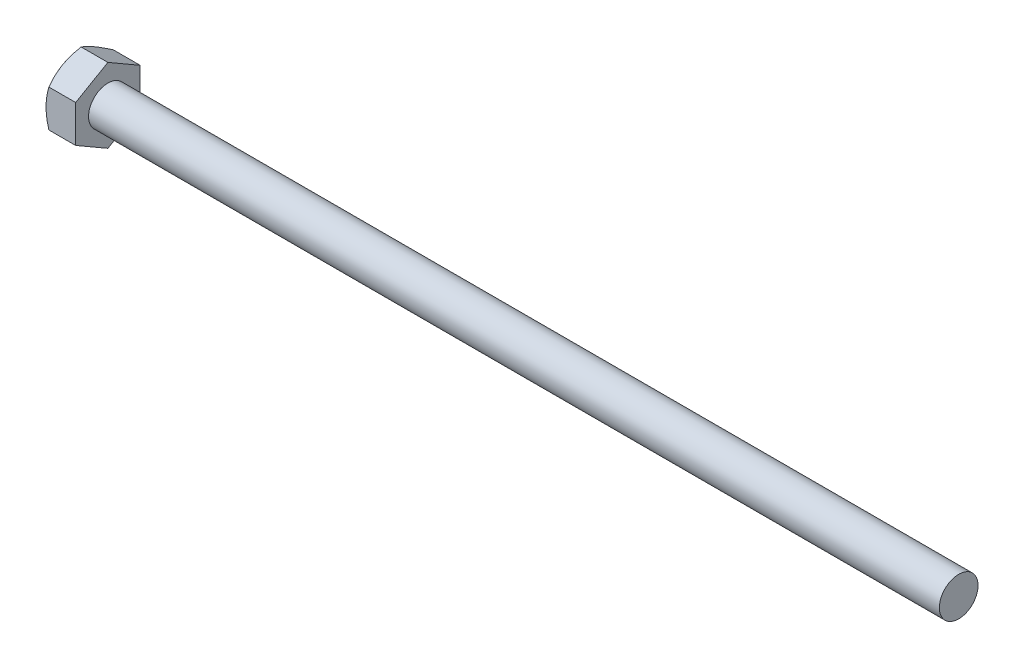
ISO-10303-21;
HEADER;
FILE_DESCRIPTION(('STEP AP214'),'2;1');
FILE_NAME('part.step','',(''),(''),'','','');
FILE_SCHEMA(('AUTOMOTIVE_DESIGN { 1 0 10303 214 1 1 1 1 }'));
ENDSEC;
DATA;
#1=APPLICATION_CONTEXT('core data for automotive mechanical design processes');
#2=APPLICATION_PROTOCOL_DEFINITION('international standard','automotive_design',2000,#1);
#3=PRODUCT_CONTEXT('',#1,'mechanical');
#4=PRODUCT('Part','Part','',(#3));
#5=PRODUCT_RELATED_PRODUCT_CATEGORY('part','',(#4));
#6=PRODUCT_DEFINITION_FORMATION('','',#4);
#7=PRODUCT_DEFINITION_CONTEXT('part definition',#1,'design');
#8=PRODUCT_DEFINITION('design','',#6,#7);
#9=PRODUCT_DEFINITION_SHAPE('','',#8);
#10=(LENGTH_UNIT() NAMED_UNIT(*) SI_UNIT(.MILLI.,.METRE.));
#11=(NAMED_UNIT(*) PLANE_ANGLE_UNIT() SI_UNIT($,.RADIAN.));
#12=(NAMED_UNIT(*) SI_UNIT($,.STERADIAN.) SOLID_ANGLE_UNIT());
#13=UNCERTAINTY_MEASURE_WITH_UNIT(LENGTH_MEASURE(1.E-05),#10,'distance_accuracy_value','');
#14=(GEOMETRIC_REPRESENTATION_CONTEXT(3) GLOBAL_UNCERTAINTY_ASSIGNED_CONTEXT((#13)) GLOBAL_UNIT_ASSIGNED_CONTEXT((#10,
#11,#12)) REPRESENTATION_CONTEXT('',''));
#15=CARTESIAN_POINT('',(0.,0.,0.));
#16=DIRECTION('',(0.,0.,1.));
#17=DIRECTION('',(1.,0.,0.));
#18=AXIS2_PLACEMENT_3D('',#15,#16,#17);
#19=CARTESIAN_POINT('',(2.3,1.5,0.));
#20=DIRECTION('',(-1.,0.,0.));
#21=DIRECTION('',(0.,0.,1.));
#22=AXIS2_PLACEMENT_3D('',#19,#20,#21);
#23=PLANE('',#22);
#24=CARTESIAN_POINT('',(2.3,0.,0.));
#25=DIRECTION('',(-1.,0.,0.));
#26=DIRECTION('',(0.,0.,1.));
#27=AXIS2_PLACEMENT_3D('',#24,#25,#26);
#28=CIRCLE('',#27,1.5);
#29=CARTESIAN_POINT('',(2.3,0.,1.5));
#30=VERTEX_POINT('',#29);
#31=EDGE_CURVE('E200',#30,#30,#28,.T.);
#32=ORIENTED_EDGE('',*,*,#31,.T.);
#33=EDGE_LOOP('',(#32));
#34=FACE_BOUND('',#33,.T.);
#35=DIRECTION('',(0.,1.,0.));
#36=VECTOR('',#35,1.);
#37=CARTESIAN_POINT('',(2.3,-1.44337567928133,2.5));
#38=LINE('',#37,#36);
#39=CARTESIAN_POINT('',(2.3,-1.44337567928133,2.5));
#40=VERTEX_POINT('',#39);
#41=CARTESIAN_POINT('',(2.3,1.44337567928159,2.5));
#42=VERTEX_POINT('',#41);
#43=EDGE_CURVE('E60',#40,#42,#38,.T.);
#44=ORIENTED_EDGE('',*,*,#43,.F.);
#45=DIRECTION('',(0.,0.50000000163871,0.866025402838329));
#46=VECTOR('',#45,1.);
#47=CARTESIAN_POINT('',(2.3,-2.8867513585628,0.));
#48=LINE('',#47,#46);
#49=CARTESIAN_POINT('',(2.3,-2.8867513585628,0.));
#50=VERTEX_POINT('',#49);
#51=EDGE_CURVE('E133',#50,#40,#48,.T.);
#52=ORIENTED_EDGE('',*,*,#51,.F.);
#53=DIRECTION('',(0.,-0.50000000163871,0.866025402838329));
#54=VECTOR('',#53,1.);
#55=CARTESIAN_POINT('',(2.3,-1.44337567928133,-2.5));
#56=LINE('',#55,#54);
#57=CARTESIAN_POINT('',(2.3,-1.44337567928133,-2.5));
#58=VERTEX_POINT('',#57);
#59=EDGE_CURVE('E131',#58,#50,#56,.T.);
#60=ORIENTED_EDGE('',*,*,#59,.F.);
#61=DIRECTION('',(0.,-1.,0.));
#62=VECTOR('',#61,1.);
#63=CARTESIAN_POINT('',(2.3,1.44337567928159,-2.5));
#64=LINE('',#63,#62);
#65=CARTESIAN_POINT('',(2.3,1.44337567928159,-2.5));
#66=VERTEX_POINT('',#65);
#67=EDGE_CURVE('E114',#66,#58,#64,.T.);
#68=ORIENTED_EDGE('',*,*,#67,.F.);
#69=DIRECTION('',(0.,-0.50000000163871,-0.866025402838329));
#70=VECTOR('',#69,1.);
#71=CARTESIAN_POINT('',(2.3,2.88675135856305,0.));
#72=LINE('',#71,#70);
#73=CARTESIAN_POINT('',(2.3,2.88675135856305,0.));
#74=VERTEX_POINT('',#73);
#75=EDGE_CURVE('E123',#74,#66,#72,.T.);
#76=ORIENTED_EDGE('',*,*,#75,.F.);
#77=DIRECTION('',(0.,0.50000000163871,-0.866025402838329));
#78=VECTOR('',#77,1.);
#79=CARTESIAN_POINT('',(2.3,1.44337567928159,2.5));
#80=LINE('',#79,#78);
#81=EDGE_CURVE('E127',#42,#74,#80,.T.);
#82=ORIENTED_EDGE('',*,*,#81,.F.);
#83=EDGE_LOOP('',(#44,#52,#60,#68,#76,#82));
#84=FACE_BOUND('',#83,.T.);
#85=ADVANCED_FACE('F37',(#34,#84),#23,.F.);
#86=CARTESIAN_POINT('',(-25.4,0.,0.));
#87=DIRECTION('',(-1.,0.,0.));
#88=DIRECTION('',(0.,0.,1.));
#89=AXIS2_PLACEMENT_3D('',#86,#87,#88);
#90=CYLINDRICAL_SURFACE('',#89,1.5);
#91=CARTESIAN_POINT('',(68.3,0.,0.));
#92=DIRECTION('',(-1.,0.,0.));
#93=DIRECTION('',(0.,0.,1.));
#94=AXIS2_PLACEMENT_3D('',#91,#92,#93);
#95=CIRCLE('',#94,1.5);
#96=CARTESIAN_POINT('',(68.3,0.,1.5));
#97=VERTEX_POINT('',#96);
#98=EDGE_CURVE('E11',#97,#97,#95,.T.);
#99=ORIENTED_EDGE('',*,*,#98,.T.);
#100=EDGE_LOOP('',(#99));
#101=FACE_BOUND('',#100,.T.);
#102=ORIENTED_EDGE('',*,*,#31,.F.);
#103=EDGE_LOOP('',(#102));
#104=FACE_BOUND('',#103,.T.);
#105=ADVANCED_FACE('F39',(#101,#104),#90,.T.);
#106=CARTESIAN_POINT('',(68.3,1.5,0.));
#107=DIRECTION('',(1.,0.,0.));
#108=DIRECTION('',(0.,0.,-1.));
#109=AXIS2_PLACEMENT_3D('',#106,#107,#108);
#110=PLANE('',#109);
#111=ORIENTED_EDGE('',*,*,#98,.F.);
#112=EDGE_LOOP('',(#111));
#113=FACE_BOUND('',#112,.T.);
#114=ADVANCED_FACE('F181',(#113),#110,.T.);
#115=CARTESIAN_POINT('',(2.3,-1.44337567928133,2.5));
#116=DIRECTION('',(0.,0.,1.));
#117=DIRECTION('',(0.,-1.,0.));
#118=AXIS2_PLACEMENT_3D('',#115,#116,#117);
#119=PLANE('',#118);
#120=DIRECTION('',(-1.,0.,0.));
#121=VECTOR('',#120,1.);
#122=CARTESIAN_POINT('',(2.3,-1.44337567928133,2.5));
#123=LINE('',#122,#121);
#124=CARTESIAN_POINT('',(0.223290995513354,-1.44337567928133,2.5));
#125=VERTEX_POINT('',#124);
#126=EDGE_CURVE('E140',#40,#125,#123,.T.);
#127=ORIENTED_EDGE('',*,*,#126,.F.);
#128=ORIENTED_EDGE('',*,*,#43,.T.);
#129=DIRECTION('',(-1.,0.,0.));
#130=VECTOR('',#129,1.);
#131=CARTESIAN_POINT('',(2.3,1.44337567928159,2.5));
#132=LINE('',#131,#130);
#133=CARTESIAN_POINT('',(0.223290995513429,1.44337567928159,2.5));
#134=VERTEX_POINT('',#133);
#135=EDGE_CURVE('E139',#42,#134,#132,.T.);
#136=ORIENTED_EDGE('',*,*,#135,.T.);
#137=CARTESIAN_POINT('',(1.19632004406595,-3.82805178069449,2.5));
#138=CARTESIAN_POINT('',(1.14327589629636,-3.7182875906123,2.5));
#139=CARTESIAN_POINT('',(1.09075904917703,-3.60826388251005,2.5));
#140=CARTESIAN_POINT('',(0.987081273872628,-3.38755710903453,2.5));
#141=CARTESIAN_POINT('',(0.935920580448254,-3.27687393351173,2.5));
#142=CARTESIAN_POINT('',(0.834986914311904,-3.05411000573681,2.5));
#143=CARTESIAN_POINT('',(0.785223558317014,-2.94202488038616,2.5));
#144=CARTESIAN_POINT('',(0.687834293242499,-2.71693339089507,2.5));
#145=CARTESIAN_POINT('',(0.64020827274816,-2.60392707513802,2.5));
#146=CARTESIAN_POINT('',(0.547096599216495,-2.37541055612811,2.5));
#147=CARTESIAN_POINT('',(0.501644402476205,-2.25988664554279,2.5));
#148=CARTESIAN_POINT('',(0.414299798759198,-2.02747621227372,2.5));
#149=CARTESIAN_POINT('',(0.372407787833691,-1.91058953963062,2.5));
#150=CARTESIAN_POINT('',(0.293309177636011,-1.67550769213624,2.5));
#151=CARTESIAN_POINT('',(0.25609261725792,-1.55731590352552,2.5));
#152=CARTESIAN_POINT('',(0.187553577101156,-1.31925207497197,2.5));
#153=CARTESIAN_POINT('',(0.156229233411223,-1.19938057931484,2.5));
#154=CARTESIAN_POINT('',(0.100995335359192,-0.957875466950475,2.5));
#155=CARTESIAN_POINT('',(0.0770877549190804,-0.836241390144261,2.5));
#156=CARTESIAN_POINT('',(0.0382970673549973,-0.591506739851933,2.5));
#157=CARTESIAN_POINT('',(0.0234139682023207,-0.468406165070562,2.5));
#158=CARTESIAN_POINT('',(0.00398887707067176,-0.222162283708564,2.5));
#159=CARTESIAN_POINT('',(-0.000618582954530851,-0.0990242760150258,2.5));
#160=CARTESIAN_POINT('',(0.000752385125691248,0.147165525321938,2.5));
#161=CARTESIAN_POINT('',(0.00672806531326748,0.270217333048273,2.5));
#162=CARTESIAN_POINT('',(0.0255487226845901,0.480345911839685,2.5));
#163=CARTESIAN_POINT('',(0.0359427194182765,0.567654504214298,2.5));
#164=CARTESIAN_POINT('',(0.0613825749513618,0.741597260879313,2.5));
#165=CARTESIAN_POINT('',(0.0764291673933814,0.828231316595431,2.5));
#166=CARTESIAN_POINT('',(0.127758160854863,1.0870510539617,2.5));
#167=CARTESIAN_POINT('',(0.170216562336702,1.258023566365,2.5));
#168=CARTESIAN_POINT('',(0.243445888381077,1.51385794210056,2.5));
#169=CARTESIAN_POINT('',(0.269819264012639,1.60005333907683,2.5));
#170=CARTESIAN_POINT('',(0.325175689355996,1.7715444847852,2.5));
#171=CARTESIAN_POINT('',(0.354156939094442,1.8568408093229,2.5));
#172=CARTESIAN_POINT('',(0.414126062328043,2.02617712827433,2.5));
#173=CARTESIAN_POINT('',(0.445101723039576,2.11022149180121,2.5));
#174=CARTESIAN_POINT('',(0.508871156887617,2.27765814571535,2.5));
#175=CARTESIAN_POINT('',(0.541665664837585,2.36105015679791,2.5));
#176=CARTESIAN_POINT('',(0.575190110848553,2.44414064056434,2.5));
#177=B_SPLINE_CURVE_WITH_KNOTS('',3,(#137,#138,#139,#140,#141,#142,#143,#144,#145,#146,#147,
#148,#149,#150,#151,#152,#153,#154,#155,#156,#157,#158,#159,#160,#161,#162,#163,#164,#165,#166,
#167,#168,#169,#170,#171,#172,#173,#174,#175,#176),.UNSPECIFIED.,.F.,.F.,(4,2,2,2,2,2,2,2,2,2,2,
2,2,2,2,2,2,2,2,4),(0.,0.365732583178816,0.731528069426235,1.0994168436567,1.46728641830588,
1.83967239293614,2.21209973939173,2.58371966044213,2.95522182687511,3.32682278147237,
3.69842406430308,4.06765095845392,4.43678199670504,4.70042859172476,4.96411678096691,
5.49188560395094,5.76228383952689,6.03249685521827,6.30118893346184,6.56999036530353),.UNSPECIFIED.);
#178=CARTESIAN_POINT('',(0.,0.,2.5));
#179=VERTEX_POINT('',#178);
#180=EDGE_CURVE('E183',#179,#134,#177,.T.);
#181=ORIENTED_EDGE('',*,*,#180,.F.);
#182=EDGE_CURVE('E191',#125,#179,#177,.T.);
#183=ORIENTED_EDGE('',*,*,#182,.F.);
#184=EDGE_LOOP('',(#127,#128,#136,#181,#183));
#185=FACE_BOUND('',#184,.T.);
#186=ADVANCED_FACE('F177',(#185),#119,.T.);
#187=CARTESIAN_POINT('',(2.3,-2.8867513585628,0.));
#188=DIRECTION('',(0.,-0.866025402838329,0.500000001638711));
#189=DIRECTION('',(0.,-0.500000001638711,-0.866025402838329));
#190=AXIS2_PLACEMENT_3D('',#187,#188,#189);
#191=PLANE('',#190);
#192=DIRECTION('',(-1.,0.,0.));
#193=VECTOR('',#192,1.);
#194=CARTESIAN_POINT('',(2.3,-2.8867513585628,0.));
#195=LINE('',#194,#193);
#196=CARTESIAN_POINT('',(0.223291000975683,-2.8867513585628,0.));
#197=VERTEX_POINT('',#196);
#198=EDGE_CURVE('E144',#50,#197,#195,.T.);
#199=ORIENTED_EDGE('',*,*,#198,.F.);
#200=ORIENTED_EDGE('',*,*,#51,.T.);
#201=ORIENTED_EDGE('',*,*,#126,.T.);
#202=CARTESIAN_POINT('',(0.223357671642481,-2.88686682861714,-0.000199999999997055));
#203=CARTESIAN_POINT('',(0.186721627123144,-2.823437260003,0.109663235061774));
#204=CARTESIAN_POINT('',(0.153402225713998,-2.75946017255779,0.220474800552927));
#205=CARTESIAN_POINT('',(0.0952422917887059,-2.63039811834957,0.444016834793913));
#206=CARTESIAN_POINT('',(0.0704223351272887,-2.5653108579734,0.556751276198274));
#207=CARTESIAN_POINT('',(0.0317856569546165,-2.43594298952786,0.780822996233662));
#208=CARTESIAN_POINT('',(0.0177118014837245,-2.37168228872263,0.892125794471919));
#209=CARTESIAN_POINT('',(0.000909157269638142,-2.24285844798616,1.1152552308786));
#210=CARTESIAN_POINT('',(-0.0018335440453357,-2.17829577643781,1.22708105778404));
#211=CARTESIAN_POINT('',(0.00386576449219316,-2.05765213161006,1.43604197932287));
#212=CARTESIAN_POINT('',(0.0109083986955485,-2.00155311785805,1.53320832097125));
#213=CARTESIAN_POINT('',(0.0332314230427739,-1.88972058300822,1.72690795242393));
#214=CARTESIAN_POINT('',(0.0485194421325141,-1.83398744884957,1.82344057202992));
#215=CARTESIAN_POINT('',(0.0867390970453044,-1.7219242510559,2.01753972341901));
#216=CARTESIAN_POINT('',(0.109832779058663,-1.66560837412358,2.11508168311234));
#217=CARTESIAN_POINT('',(0.162246658960904,-1.55381666130744,2.3087106087289));
#218=CARTESIAN_POINT('',(0.191554537725398,-1.49833939269559,2.40480005620986));
#219=CARTESIAN_POINT('',(0.223357666179496,-1.44326020922699,2.5002));
#220=B_SPLINE_CURVE_WITH_KNOTS('',3,(#202,#203,#204,#205,#206,#207,#208,#209,#210,#211,#212,
#213,#214,#215,#216,#217,#218,#219),.UNSPECIFIED.,.F.,.F.,(4,2,2,2,2,2,2,2,4),(0.,
0.396285829073731,0.793524333587547,1.18093087363639,1.56786160813528,1.90479742383017,
2.24204552159359,2.58677531937551,2.93082800409491),.UNSPECIFIED.);
#221=CARTESIAN_POINT('',(0.,-2.16506351419155,1.2500000081935));
#222=VERTEX_POINT('',#221);
#223=EDGE_CURVE('E193',#222,#125,#220,.T.);
#224=ORIENTED_EDGE('',*,*,#223,.F.);
#225=EDGE_CURVE('E192',#197,#222,#220,.T.);
#226=ORIENTED_EDGE('',*,*,#225,.F.);
#227=EDGE_LOOP('',(#199,#200,#201,#224,#226));
#228=FACE_BOUND('',#227,.T.);
#229=ADVANCED_FACE('F180',(#228),#191,.T.);
#230=CARTESIAN_POINT('',(2.3,-1.44337567928133,-2.5));
#231=DIRECTION('',(0.,-0.866025402838329,-0.50000000163871));
#232=DIRECTION('',(0.,0.50000000163871,-0.866025402838329));
#233=AXIS2_PLACEMENT_3D('',#230,#231,#232);
#234=PLANE('',#233);
#235=DIRECTION('',(-1.,0.,0.));
#236=VECTOR('',#235,1.);
#237=CARTESIAN_POINT('',(2.3,-1.44337567928133,-2.5));
#238=LINE('',#237,#236);
#239=CARTESIAN_POINT('',(0.223290995513354,-1.44337567928133,-2.5));
#240=VERTEX_POINT('',#239);
#241=EDGE_CURVE('E120',#58,#240,#238,.T.);
#242=ORIENTED_EDGE('',*,*,#241,.F.);
#243=ORIENTED_EDGE('',*,*,#59,.T.);
#244=ORIENTED_EDGE('',*,*,#198,.T.);
#245=CARTESIAN_POINT('',(0.223357666179496,-1.44326020922699,-2.5002));
#246=CARTESIAN_POINT('',(0.186721622105297,-1.5066897776876,-2.39033676520415));
#247=CARTESIAN_POINT('',(0.153402221169772,-1.57066686497833,-2.27952519998057));
#248=CARTESIAN_POINT('',(0.0952422882291764,-1.69972891886277,-2.05598316630038));
#249=CARTESIAN_POINT('',(0.0704223320783219,-1.76481617906955,-1.94324872518942));
#250=CARTESIAN_POINT('',(0.0317856549217424,-1.89418404716996,-1.71917700575181));
#251=CARTESIAN_POINT('',(0.0177117999573057,-1.95844474779998,-1.60787420781702));
#252=CARTESIAN_POINT('',(0.00090915671970467,-2.08726858816535,-1.38474477205312));
#253=CARTESIAN_POINT('',(-0.00183354412493002,-2.15183125951782,-1.27291894548693));
#254=CARTESIAN_POINT('',(0.00386576523131279,-2.27247490433789,-1.0639580239614));
#255=CARTESIAN_POINT('',(0.0109083998520694,-2.3285739182796,-0.966791681984465));
#256=CARTESIAN_POINT('',(0.0332314250552663,-2.44040645349358,-0.773092049901063));
#257=CARTESIAN_POINT('',(0.048519444583664,-2.49613958782666,-0.676559429992934));
#258=CARTESIAN_POINT('',(0.0867391003778061,-2.60820278596567,-0.48246027800571));
#259=CARTESIAN_POINT('',(0.109832782834311,-2.66451866306856,-0.384918318016938));
#260=CARTESIAN_POINT('',(0.162246663600414,-2.77631037621612,-0.191289391826346));
#261=CARTESIAN_POINT('',(0.19155454278545,-2.83178764498885,-0.0951999440667246));
#262=CARTESIAN_POINT('',(0.223357671642481,-2.88686682861714,0.000200000000003285));
#263=B_SPLINE_CURVE_WITH_KNOTS('',3,(#245,#246,#247,#248,#249,#250,#251,#252,#253,#254,#255,
#256,#257,#258,#259,#260,#261,#262),.UNSPECIFIED.,.F.,.F.,(4,2,2,2,2,2,2,2,4),(0.,
0.396285827816312,0.793524331042151,1.18093086988015,1.56786160317875,1.90479742008592,
2.24204551906553,2.58677531811864,2.9308280040949),.UNSPECIFIED.);
#264=CARTESIAN_POINT('',(0.,-2.16506351419155,-1.25000000819349));
#265=VERTEX_POINT('',#264);
#266=EDGE_CURVE('E223',#265,#197,#263,.T.);
#267=ORIENTED_EDGE('',*,*,#266,.F.);
#268=EDGE_CURVE('E228',#240,#265,#263,.T.);
#269=ORIENTED_EDGE('',*,*,#268,.F.);
#270=EDGE_LOOP('',(#242,#243,#244,#267,#269));
#271=FACE_BOUND('',#270,.T.);
#272=ADVANCED_FACE('F299',(#271),#234,.T.);
#273=CARTESIAN_POINT('',(2.3,1.44337567928159,-2.5));
#274=DIRECTION('',(0.,0.,-1.));
#275=DIRECTION('',(0.,1.,0.));
#276=AXIS2_PLACEMENT_3D('',#273,#274,#275);
#277=PLANE('',#276);
#278=DIRECTION('',(-1.,0.,0.));
#279=VECTOR('',#278,1.);
#280=CARTESIAN_POINT('',(2.3,1.44337567928159,-2.5));
#281=LINE('',#280,#279);
#282=CARTESIAN_POINT('',(0.223290995513426,1.44337567928159,-2.5));
#283=VERTEX_POINT('',#282);
#284=EDGE_CURVE('E109',#66,#283,#281,.T.);
#285=ORIENTED_EDGE('',*,*,#284,.F.);
#286=ORIENTED_EDGE('',*,*,#67,.T.);
#287=ORIENTED_EDGE('',*,*,#241,.T.);
#288=CARTESIAN_POINT('',(1.19632004406595,-3.82805178069449,-2.5));
#289=CARTESIAN_POINT('',(1.14327589629636,-3.71828759061229,-2.5));
#290=CARTESIAN_POINT('',(1.09075904917703,-3.60826388251005,-2.5));
#291=CARTESIAN_POINT('',(0.987081273872629,-3.38755710903453,-2.5));
#292=CARTESIAN_POINT('',(0.935920580448254,-3.27687393351173,-2.5));
#293=CARTESIAN_POINT('',(0.834986914311905,-3.05411000573681,-2.5));
#294=CARTESIAN_POINT('',(0.785223558317014,-2.94202488038616,-2.5));
#295=CARTESIAN_POINT('',(0.687834293242499,-2.71693339089507,-2.5));
#296=CARTESIAN_POINT('',(0.64020827274816,-2.60392707513802,-2.5));
#297=CARTESIAN_POINT('',(0.547096599216495,-2.3754105561281,-2.5));
#298=CARTESIAN_POINT('',(0.501644402476205,-2.25988664554279,-2.5));
#299=CARTESIAN_POINT('',(0.414299798759198,-2.02747621227372,-2.5));
#300=CARTESIAN_POINT('',(0.372407787833692,-1.91058953963062,-2.5));
#301=CARTESIAN_POINT('',(0.293309177636011,-1.67550769213624,-2.5));
#302=CARTESIAN_POINT('',(0.25609261725792,-1.55731590352552,-2.5));
#303=CARTESIAN_POINT('',(0.187553577101155,-1.31925207497197,-2.5));
#304=CARTESIAN_POINT('',(0.156229233411223,-1.19938057931484,-2.5));
#305=CARTESIAN_POINT('',(0.100995335359191,-0.957875466950474,-2.5));
#306=CARTESIAN_POINT('',(0.0770877549190793,-0.836241390144261,-2.5));
#307=CARTESIAN_POINT('',(0.0382970673549961,-0.591506739851933,-2.5));
#308=CARTESIAN_POINT('',(0.0234139682023195,-0.468406165070563,-2.5));
#309=CARTESIAN_POINT('',(0.00398887707067026,-0.222162283708564,-2.5));
#310=CARTESIAN_POINT('',(-0.000618582954532723,-0.099024276015026,-2.5));
#311=CARTESIAN_POINT('',(0.000752385125689055,0.147165525321938,-2.5));
#312=CARTESIAN_POINT('',(0.00672806531326533,0.270217333048273,-2.5));
#313=CARTESIAN_POINT('',(0.0255487226845878,0.480345911839685,-2.5));
#314=CARTESIAN_POINT('',(0.0359427194182741,0.567654504214298,-2.5));
#315=CARTESIAN_POINT('',(0.0613825749513591,0.741597260879313,-2.5));
#316=CARTESIAN_POINT('',(0.0764291673933784,0.82823131659543,-2.5));
#317=CARTESIAN_POINT('',(0.127758160854859,1.0870510539617,-2.5));
#318=CARTESIAN_POINT('',(0.170216562336698,1.25802356636499,-2.5));
#319=CARTESIAN_POINT('',(0.243445888381073,1.51385794210056,-2.5));
#320=CARTESIAN_POINT('',(0.269819264012635,1.60005333907683,-2.5));
#321=CARTESIAN_POINT('',(0.325175689355992,1.77154448478519,-2.5));
#322=CARTESIAN_POINT('',(0.354156939094438,1.85684080932289,-2.5));
#323=CARTESIAN_POINT('',(0.414126062328038,2.02617712827432,-2.5));
#324=CARTESIAN_POINT('',(0.445101723039571,2.1102214918012,-2.5));
#325=CARTESIAN_POINT('',(0.508871156887612,2.27765814571535,-2.5));
#326=CARTESIAN_POINT('',(0.541665664837579,2.36105015679791,-2.5));
#327=CARTESIAN_POINT('',(0.575190110848547,2.44414064056433,-2.5));
#328=B_SPLINE_CURVE_WITH_KNOTS('',3,(#288,#289,#290,#291,#292,#293,#294,#295,#296,#297,#298,
#299,#300,#301,#302,#303,#304,#305,#306,#307,#308,#309,#310,#311,#312,#313,#314,#315,#316,#317,
#318,#319,#320,#321,#322,#323,#324,#325,#326,#327),.UNSPECIFIED.,.F.,.F.,(4,2,2,2,2,2,2,2,2,2,2,
2,2,2,2,2,2,2,2,4),(0.,0.365732583178816,0.731528069426236,1.0994168436567,1.46728641830589,
1.83967239293614,2.21209973939173,2.58371966044213,2.95522182687511,3.32682278147237,
3.69842406430308,4.06765095845392,4.43678199670504,4.70042859172476,4.96411678096691,
5.49188560395093,5.76228383952689,6.03249685521826,6.30118893346183,6.56999036530352),.UNSPECIFIED.);
#329=CARTESIAN_POINT('',(0.,0.,-2.5));
#330=VERTEX_POINT('',#329);
#331=EDGE_CURVE('E224',#330,#240,#328,.F.);
#332=ORIENTED_EDGE('',*,*,#331,.F.);
#333=EDGE_CURVE('E117',#283,#330,#328,.F.);
#334=ORIENTED_EDGE('',*,*,#333,.F.);
#335=EDGE_LOOP('',(#285,#286,#287,#332,#334));
#336=FACE_BOUND('',#335,.T.);
#337=ADVANCED_FACE('F111',(#336),#277,.T.);
#338=CARTESIAN_POINT('',(2.3,2.88675135856305,0.));
#339=DIRECTION('',(0.,0.866025402838329,-0.50000000163871));
#340=DIRECTION('',(0.,0.50000000163871,0.866025402838329));
#341=AXIS2_PLACEMENT_3D('',#338,#339,#340);
#342=PLANE('',#341);
#343=DIRECTION('',(-1.,0.,0.));
#344=VECTOR('',#343,1.);
#345=CARTESIAN_POINT('',(2.3,2.88675135856305,0.));
#346=LINE('',#345,#344);
#347=CARTESIAN_POINT('',(0.223291000975831,2.88675135856305,0.));
#348=VERTEX_POINT('',#347);
#349=EDGE_CURVE('E52',#74,#348,#346,.T.);
#350=ORIENTED_EDGE('',*,*,#349,.F.);
#351=ORIENTED_EDGE('',*,*,#75,.T.);
#352=ORIENTED_EDGE('',*,*,#284,.T.);
#353=CARTESIAN_POINT('',(0.223357671642628,2.88686682861739,0.000200000000002865));
#354=CARTESIAN_POINT('',(0.186721627123289,2.82343726000325,-0.109663235061778));
#355=CARTESIAN_POINT('',(0.15340222571414,2.75946017255803,-0.22047480055294));
#356=CARTESIAN_POINT('',(0.0952422917888422,2.6303981183498,-0.444016834793946));
#357=CARTESIAN_POINT('',(0.0704223351274228,2.56531085797362,-0.556751276198317));
#358=CARTESIAN_POINT('',(0.0317856569547468,2.43594298952807,-0.780822996233725));
#359=CARTESIAN_POINT('',(0.0177118014838533,2.37168228872284,-0.892125794471992));
#360=CARTESIAN_POINT('',(0.000909157269765117,2.24285844798636,-1.11525523087869));
#361=CARTESIAN_POINT('',(-0.00183354404520911,2.17829577643801,-1.22708105778415));
#362=CARTESIAN_POINT('',(0.00386576449231955,2.05765213161025,-1.43604197932297));
#363=CARTESIAN_POINT('',(0.0109083986956732,2.00155311785825,-1.53320832097134));
#364=CARTESIAN_POINT('',(0.033231423042893,1.88972058300843,-1.726907952424));
#365=CARTESIAN_POINT('',(0.0485194421326293,1.83398744884979,-1.82344057202999));
#366=CARTESIAN_POINT('',(0.0867390970454098,1.72192425105612,-2.01753972341906));
#367=CARTESIAN_POINT('',(0.109832779058763,1.66560837412381,-2.11508168311237));
#368=CARTESIAN_POINT('',(0.16224665896099,1.55381666130769,-2.30871060872891));
#369=CARTESIAN_POINT('',(0.191554537725478,1.49833939269584,-2.40480005620987));
#370=CARTESIAN_POINT('',(0.223357666179568,1.44326020922725,-2.5002));
#371=B_SPLINE_CURVE_WITH_KNOTS('',3,(#353,#354,#355,#356,#357,#358,#359,#360,#361,#362,#363,
#364,#365,#366,#367,#368,#369,#370),.UNSPECIFIED.,.F.,.F.,(4,2,2,2,2,2,2,2,4),(0.,
0.396285829073766,0.793524333587617,1.1809308736365,1.56786160813542,1.90479742383028,
2.24204552159366,2.58677531937554,2.93082800409491),.UNSPECIFIED.);
#372=CARTESIAN_POINT('',(0.,2.16506351419174,-1.2500000081936));
#373=VERTEX_POINT('',#372);
#374=EDGE_CURVE('E159',#373,#283,#371,.T.);
#375=ORIENTED_EDGE('',*,*,#374,.F.);
#376=EDGE_CURVE('E287',#348,#373,#371,.T.);
#377=ORIENTED_EDGE('',*,*,#376,.F.);
#378=EDGE_LOOP('',(#350,#351,#352,#375,#377));
#379=FACE_BOUND('',#378,.T.);
#380=ADVANCED_FACE('F124',(#379),#342,.T.);
#381=CARTESIAN_POINT('',(2.3,1.44337567928159,2.5));
#382=DIRECTION('',(0.,0.866025402838329,0.50000000163871));
#383=DIRECTION('',(0.,-0.50000000163871,0.866025402838329));
#384=AXIS2_PLACEMENT_3D('',#381,#382,#383);
#385=PLANE('',#384);
#386=ORIENTED_EDGE('',*,*,#135,.F.);
#387=ORIENTED_EDGE('',*,*,#81,.T.);
#388=ORIENTED_EDGE('',*,*,#349,.T.);
#389=CARTESIAN_POINT('',(0.223357666179571,1.44326020922725,2.5002));
#390=CARTESIAN_POINT('',(0.186721622105376,1.50668977768786,2.39033676520415));
#391=CARTESIAN_POINT('',(0.153402221169854,1.57066686497859,2.27952519998056));
#392=CARTESIAN_POINT('',(0.0952422882292661,1.69972891886304,2.05598316630036));
#393=CARTESIAN_POINT('',(0.0704223320784162,1.76481617906983,1.94324872518939));
#394=CARTESIAN_POINT('',(0.0317856549218469,1.89418404717024,1.71917700575177));
#395=CARTESIAN_POINT('',(0.0177117999574159,1.95844474780027,1.60787420781697));
#396=CARTESIAN_POINT('',(0.000909156719826574,2.08726858816564,1.38474477205306));
#397=CARTESIAN_POINT('',(-0.00183354412480209,2.15183125951811,1.27291894548687));
#398=CARTESIAN_POINT('',(0.00386576523145182,2.27247490433819,1.06395802396134));
#399=CARTESIAN_POINT('',(0.0109083998522126,2.32857391827989,0.966791681984408));
#400=CARTESIAN_POINT('',(0.0332314250554153,2.44040645349386,0.773092049901018));
#401=CARTESIAN_POINT('',(0.0485194445838148,2.49613958782694,0.676559429992895));
#402=CARTESIAN_POINT('',(0.0867391003779589,2.60820278596594,0.482460278005685));
#403=CARTESIAN_POINT('',(0.109832782834464,2.66451866306883,0.38491831801692));
#404=CARTESIAN_POINT('',(0.162246663600566,2.77631037621638,0.19128939182634));
#405=CARTESIAN_POINT('',(0.1915545427856,2.83178764498911,0.095199944066725));
#406=CARTESIAN_POINT('',(0.223357671642629,2.88686682861739,-0.000199999999997085));
#407=B_SPLINE_CURVE_WITH_KNOTS('',3,(#389,#390,#391,#392,#393,#394,#395,#396,#397,#398,#399,
#400,#401,#402,#403,#404,#405,#406),.UNSPECIFIED.,.F.,.F.,(4,2,2,2,2,2,2,2,4),(0.,
0.396285827816331,0.793524331042187,1.1809308698802,1.56786160317882,1.90479742008597,
2.24204551906556,2.58677531811865,2.93082800409489),.UNSPECIFIED.);
#408=CARTESIAN_POINT('',(0.,2.16506351419174,1.25000000819361));
#409=VERTEX_POINT('',#408);
#410=EDGE_CURVE('E143',#409,#348,#407,.T.);
#411=ORIENTED_EDGE('',*,*,#410,.F.);
#412=EDGE_CURVE('E158',#134,#409,#407,.T.);
#413=ORIENTED_EDGE('',*,*,#412,.F.);
#414=EDGE_LOOP('',(#386,#387,#388,#411,#413));
#415=FACE_BOUND('',#414,.T.);
#416=ADVANCED_FACE('F170',(#415),#385,.T.);
#417=CARTESIAN_POINT('',(0.,0.,0.));
#418=DIRECTION('',(1.,0.,0.));
#419=DIRECTION('',(0.,0.,-1.));
#420=AXIS2_PLACEMENT_3D('',#417,#418,#419);
#421=CONICAL_SURFACE('',#420,2.5,1.0471975511966);
#422=CARTESIAN_POINT('',(0.,0.,0.));
#423=DIRECTION('',(-1.,0.,0.));
#424=DIRECTION('',(0.,0.,1.));
#425=AXIS2_PLACEMENT_3D('',#422,#423,#424);
#426=CIRCLE('',#425,2.5);
#427=EDGE_CURVE('E202',#222,#179,#426,.T.);
#428=ORIENTED_EDGE('',*,*,#427,.F.);
#429=ORIENTED_EDGE('',*,*,#223,.T.);
#430=ORIENTED_EDGE('',*,*,#182,.T.);
#431=EDGE_LOOP('',(#428,#429,#430));
#432=FACE_BOUND('',#431,.T.);
#433=ADVANCED_FACE('F174',(#432),#421,.T.);
#434=EDGE_CURVE('E210',#265,#222,#426,.T.);
#435=ORIENTED_EDGE('',*,*,#434,.F.);
#436=ORIENTED_EDGE('',*,*,#266,.T.);
#437=ORIENTED_EDGE('',*,*,#225,.T.);
#438=EDGE_LOOP('',(#435,#436,#437));
#439=FACE_BOUND('',#438,.T.);
#440=ADVANCED_FACE('F233',(#439),#421,.T.);
#441=ORIENTED_EDGE('',*,*,#331,.T.);
#442=ORIENTED_EDGE('',*,*,#268,.T.);
#443=EDGE_CURVE('E213',#330,#265,#426,.T.);
#444=ORIENTED_EDGE('',*,*,#443,.F.);
#445=EDGE_LOOP('',(#441,#442,#444));
#446=FACE_BOUND('',#445,.T.);
#447=ADVANCED_FACE('F166',(#446),#421,.T.);
#448=ORIENTED_EDGE('',*,*,#374,.T.);
#449=ORIENTED_EDGE('',*,*,#333,.T.);
#450=EDGE_CURVE('E209',#373,#330,#426,.T.);
#451=ORIENTED_EDGE('',*,*,#450,.F.);
#452=EDGE_LOOP('',(#448,#449,#451));
#453=FACE_BOUND('',#452,.T.);
#454=ADVANCED_FACE('F222',(#453),#421,.T.);
#455=EDGE_CURVE('E45',#179,#409,#426,.T.);
#456=ORIENTED_EDGE('',*,*,#455,.F.);
#457=ORIENTED_EDGE('',*,*,#180,.T.);
#458=ORIENTED_EDGE('',*,*,#412,.T.);
#459=EDGE_LOOP('',(#456,#457,#458));
#460=FACE_BOUND('',#459,.T.);
#461=ADVANCED_FACE('F261',(#460),#421,.T.);
#462=CARTESIAN_POINT('',(0.,0.,0.));
#463=DIRECTION('',(-1.,0.,0.));
#464=DIRECTION('',(0.,0.,1.));
#465=AXIS2_PLACEMENT_3D('',#462,#463,#464);
#466=PLANE('',#465);
#467=CARTESIAN_POINT('',(0.,0.,0.));
#468=DIRECTION('',(1.,0.,0.));
#469=DIRECTION('',(0.,0.,-1.));
#470=AXIS2_PLACEMENT_3D('',#467,#468,#469);
#471=CIRCLE('',#470,2.1875);
#472=CARTESIAN_POINT('',(0.,0.,-2.1875));
#473=VERTEX_POINT('',#472);
#474=EDGE_CURVE('E241',#473,#473,#471,.T.);
#475=ORIENTED_EDGE('',*,*,#474,.T.);
#476=EDGE_LOOP('',(#475));
#477=FACE_BOUND('',#476,.T.);
#478=ORIENTED_EDGE('',*,*,#455,.T.);
#479=EDGE_CURVE('E204',#409,#373,#426,.T.);
#480=ORIENTED_EDGE('',*,*,#479,.T.);
#481=ORIENTED_EDGE('',*,*,#450,.T.);
#482=ORIENTED_EDGE('',*,*,#443,.T.);
#483=ORIENTED_EDGE('',*,*,#434,.T.);
#484=ORIENTED_EDGE('',*,*,#427,.T.);
#485=EDGE_LOOP('',(#478,#480,#481,#482,#483,#484));
#486=FACE_BOUND('',#485,.T.);
#487=ADVANCED_FACE('F219',(#477,#486),#466,.T.);
#488=ORIENTED_EDGE('',*,*,#410,.T.);
#489=ORIENTED_EDGE('',*,*,#376,.T.);
#490=ORIENTED_EDGE('',*,*,#479,.F.);
#491=EDGE_LOOP('',(#488,#489,#490));
#492=FACE_BOUND('',#491,.T.);
#493=ADVANCED_FACE('F251',(#492),#421,.T.);
#494=CARTESIAN_POINT('',(0.2875,0.,0.));
#495=DIRECTION('',(-1.,0.,0.));
#496=DIRECTION('',(0.,0.,1.));
#497=AXIS2_PLACEMENT_3D('',#494,#495,#496);
#498=CYLINDRICAL_SURFACE('',#497,2.1875);
#499=CARTESIAN_POINT('',(0.2875,0.,0.));
#500=DIRECTION('',(1.,0.,0.));
#501=DIRECTION('',(0.,0.,-1.));
#502=AXIS2_PLACEMENT_3D('',#499,#500,#501);
#503=CIRCLE('',#502,2.1875);
#504=CARTESIAN_POINT('',(0.2875,0.,-2.1875));
#505=VERTEX_POINT('',#504);
#506=EDGE_CURVE('E238',#505,#505,#503,.T.);
#507=ORIENTED_EDGE('',*,*,#506,.T.);
#508=EDGE_LOOP('',(#507));
#509=FACE_BOUND('',#508,.T.);
#510=ORIENTED_EDGE('',*,*,#474,.F.);
#511=EDGE_LOOP('',(#510));
#512=FACE_BOUND('',#511,.T.);
#513=ADVANCED_FACE('F248',(#509,#512),#498,.F.);
#514=CARTESIAN_POINT('',(0.2875,0.,0.));
#515=DIRECTION('',(1.,0.,0.));
#516=DIRECTION('',(0.,0.,-1.));
#517=AXIS2_PLACEMENT_3D('',#514,#515,#516);
#518=PLANE('',#517);
#519=ORIENTED_EDGE('',*,*,#506,.F.);
#520=EDGE_LOOP('',(#519));
#521=FACE_BOUND('',#520,.T.);
#522=ADVANCED_FACE('F250',(#521),#518,.F.);
#523=CLOSED_SHELL('',(#85,#105,#114,#186,#229,#272,#337,#380,#416,#433,#440,#447,#454,#461,#487,
#493,#513,#522));
#524=MANIFOLD_SOLID_BREP('B2',#523);
#525=ADVANCED_BREP_SHAPE_REPRESENTATION('',(#18,#524),#14);
#526=SHAPE_DEFINITION_REPRESENTATION(#9,#525);
ENDSEC;
END-ISO-10303-21;
